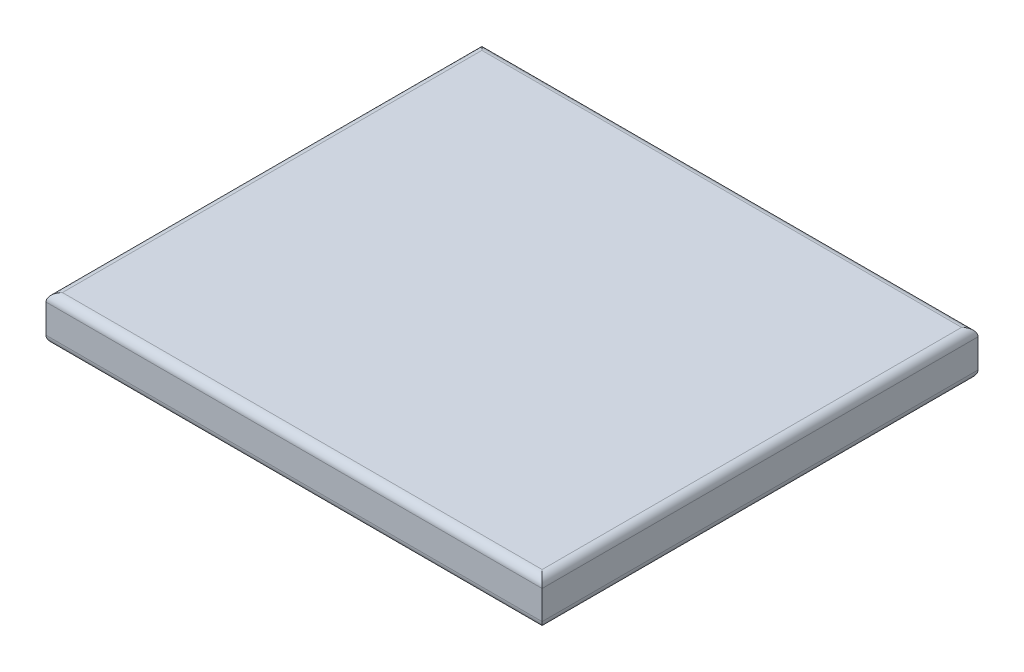
ISO-10303-21;
HEADER;
FILE_DESCRIPTION(('STEP AP214'),'2;1');
FILE_NAME('part.step','',(''),(''),'','','');
FILE_SCHEMA(('AUTOMOTIVE_DESIGN { 1 0 10303 214 1 1 1 1 }'));
ENDSEC;
DATA;
#1=APPLICATION_CONTEXT('core data for automotive mechanical design processes');
#2=APPLICATION_PROTOCOL_DEFINITION('international standard','automotive_design',2000,#1);
#3=PRODUCT_CONTEXT('',#1,'mechanical');
#4=PRODUCT('Part','Part','',(#3));
#5=PRODUCT_RELATED_PRODUCT_CATEGORY('part','',(#4));
#6=PRODUCT_DEFINITION_FORMATION('','',#4);
#7=PRODUCT_DEFINITION_CONTEXT('part definition',#1,'design');
#8=PRODUCT_DEFINITION('design','',#6,#7);
#9=PRODUCT_DEFINITION_SHAPE('','',#8);
#10=(LENGTH_UNIT() NAMED_UNIT(*) SI_UNIT(.MILLI.,.METRE.));
#11=(NAMED_UNIT(*) PLANE_ANGLE_UNIT() SI_UNIT($,.RADIAN.));
#12=(NAMED_UNIT(*) SI_UNIT($,.STERADIAN.) SOLID_ANGLE_UNIT());
#13=UNCERTAINTY_MEASURE_WITH_UNIT(LENGTH_MEASURE(1.E-05),#10,'distance_accuracy_value','');
#14=(GEOMETRIC_REPRESENTATION_CONTEXT(3) GLOBAL_UNCERTAINTY_ASSIGNED_CONTEXT((#13)) GLOBAL_UNIT_ASSIGNED_CONTEXT((#10,
#11,#12)) REPRESENTATION_CONTEXT('',''));
#15=CARTESIAN_POINT('',(0.,0.,0.));
#16=DIRECTION('',(0.,0.,1.));
#17=DIRECTION('',(1.,0.,0.));
#18=AXIS2_PLACEMENT_3D('',#15,#16,#17);
#19=CARTESIAN_POINT('',(0.,5.5,0.));
#20=DIRECTION('',(1.,0.,0.));
#21=DIRECTION('',(0.,0.,-1.));
#22=AXIS2_PLACEMENT_3D('',#19,#20,#21);
#23=PLANE('',#22);
#24=DIRECTION('',(0.,-1.,0.));
#25=VECTOR('',#24,1.);
#26=CARTESIAN_POINT('',(0.,5.5,-53.15));
#27=LINE('',#26,#25);
#28=CARTESIAN_POINT('',(0.,4.5,-53.15));
#29=VERTEX_POINT('',#28);
#30=CARTESIAN_POINT('',(0.,1.,-53.15));
#31=VERTEX_POINT('',#30);
#32=EDGE_CURVE('E142',#29,#31,#27,.T.);
#33=ORIENTED_EDGE('',*,*,#32,.T.);
#34=DIRECTION('',(0.,0.,1.));
#35=VECTOR('',#34,1.);
#36=CARTESIAN_POINT('',(0.,1.,0.));
#37=LINE('',#36,#35);
#38=CARTESIAN_POINT('',(0.,1.,0.));
#39=VERTEX_POINT('',#38);
#40=EDGE_CURVE('E151',#31,#39,#37,.T.);
#41=ORIENTED_EDGE('',*,*,#40,.T.);
#42=DIRECTION('',(0.,-1.,0.));
#43=VECTOR('',#42,1.);
#44=CARTESIAN_POINT('',(0.,5.5,0.));
#45=LINE('',#44,#43);
#46=CARTESIAN_POINT('',(0.,4.5,0.));
#47=VERTEX_POINT('',#46);
#48=EDGE_CURVE('E120',#47,#39,#45,.T.);
#49=ORIENTED_EDGE('',*,*,#48,.F.);
#50=DIRECTION('',(0.,0.,1.));
#51=VECTOR('',#50,1.);
#52=CARTESIAN_POINT('',(0.,4.5,0.));
#53=LINE('',#52,#51);
#54=EDGE_CURVE('E153',#47,#29,#53,.F.);
#55=ORIENTED_EDGE('',*,*,#54,.T.);
#56=EDGE_LOOP('',(#33,#41,#49,#55));
#57=FACE_BOUND('',#56,.T.);
#58=ADVANCED_FACE('F33',(#57),#23,.F.);
#59=CARTESIAN_POINT('',(0.,5.5,0.));
#60=DIRECTION('',(0.,0.,-1.));
#61=DIRECTION('',(-1.,0.,0.));
#62=AXIS2_PLACEMENT_3D('',#59,#60,#61);
#63=PLANE('',#62);
#64=ORIENTED_EDGE('',*,*,#48,.T.);
#65=DIRECTION('',(1.,0.,0.));
#66=VECTOR('',#65,1.);
#67=CARTESIAN_POINT('',(60.5,1.,0.));
#68=LINE('',#67,#66);
#69=CARTESIAN_POINT('',(60.5,1.,0.));
#70=VERTEX_POINT('',#69);
#71=EDGE_CURVE('E119',#39,#70,#68,.T.);
#72=ORIENTED_EDGE('',*,*,#71,.T.);
#73=DIRECTION('',(0.,-1.,0.));
#74=VECTOR('',#73,1.);
#75=CARTESIAN_POINT('',(60.5,5.5,0.));
#76=LINE('',#75,#74);
#77=CARTESIAN_POINT('',(60.5,4.5,0.));
#78=VERTEX_POINT('',#77);
#79=EDGE_CURVE('E102',#78,#70,#76,.T.);
#80=ORIENTED_EDGE('',*,*,#79,.F.);
#81=DIRECTION('',(1.,0.,0.));
#82=VECTOR('',#81,1.);
#83=CARTESIAN_POINT('',(0.,4.5,0.));
#84=LINE('',#83,#82);
#85=EDGE_CURVE('E116',#78,#47,#84,.F.);
#86=ORIENTED_EDGE('',*,*,#85,.T.);
#87=EDGE_LOOP('',(#64,#72,#80,#86));
#88=FACE_BOUND('',#87,.T.);
#89=ADVANCED_FACE('F115',(#88),#63,.F.);
#90=CARTESIAN_POINT('',(60.5,5.5,0.));
#91=DIRECTION('',(-1.,0.,0.));
#92=DIRECTION('',(0.,0.,1.));
#93=AXIS2_PLACEMENT_3D('',#90,#91,#92);
#94=PLANE('',#93);
#95=ORIENTED_EDGE('',*,*,#79,.T.);
#96=DIRECTION('',(0.,0.,-1.));
#97=VECTOR('',#96,1.);
#98=CARTESIAN_POINT('',(60.5,1.,-53.15));
#99=LINE('',#98,#97);
#100=CARTESIAN_POINT('',(60.5,1.,-53.15));
#101=VERTEX_POINT('',#100);
#102=EDGE_CURVE('E108',#70,#101,#99,.T.);
#103=ORIENTED_EDGE('',*,*,#102,.T.);
#104=DIRECTION('',(0.,-1.,0.));
#105=VECTOR('',#104,1.);
#106=CARTESIAN_POINT('',(60.5,5.5,-53.15));
#107=LINE('',#106,#105);
#108=CARTESIAN_POINT('',(60.5,4.5,-53.15));
#109=VERTEX_POINT('',#108);
#110=EDGE_CURVE('E104',#109,#101,#107,.T.);
#111=ORIENTED_EDGE('',*,*,#110,.F.);
#112=DIRECTION('',(0.,0.,-1.));
#113=VECTOR('',#112,1.);
#114=CARTESIAN_POINT('',(60.5,4.5,0.));
#115=LINE('',#114,#113);
#116=EDGE_CURVE('E99',#109,#78,#115,.F.);
#117=ORIENTED_EDGE('',*,*,#116,.T.);
#118=EDGE_LOOP('',(#95,#103,#111,#117));
#119=FACE_BOUND('',#118,.T.);
#120=ADVANCED_FACE('F101',(#119),#94,.F.);
#121=CARTESIAN_POINT('',(0.,5.5,-53.15));
#122=DIRECTION('',(0.,0.,1.));
#123=DIRECTION('',(1.,0.,0.));
#124=AXIS2_PLACEMENT_3D('',#121,#122,#123);
#125=PLANE('',#124);
#126=ORIENTED_EDGE('',*,*,#110,.T.);
#127=DIRECTION('',(-1.,0.,0.));
#128=VECTOR('',#127,1.);
#129=CARTESIAN_POINT('',(0.,1.,-53.15));
#130=LINE('',#129,#128);
#131=EDGE_CURVE('E155',#101,#31,#130,.T.);
#132=ORIENTED_EDGE('',*,*,#131,.T.);
#133=ORIENTED_EDGE('',*,*,#32,.F.);
#134=DIRECTION('',(-1.,0.,0.));
#135=VECTOR('',#134,1.);
#136=CARTESIAN_POINT('',(0.,4.5,-53.15));
#137=LINE('',#136,#135);
#138=EDGE_CURVE('E157',#29,#109,#137,.F.);
#139=ORIENTED_EDGE('',*,*,#138,.T.);
#140=EDGE_LOOP('',(#126,#132,#133,#139));
#141=FACE_BOUND('',#140,.T.);
#142=ADVANCED_FACE('F195',(#141),#125,.F.);
#143=CARTESIAN_POINT('',(0.,5.5,-53.15));
#144=DIRECTION('',(0.,-1.,0.));
#145=DIRECTION('',(0.,0.,-1.));
#146=AXIS2_PLACEMENT_3D('',#143,#144,#145);
#147=PLANE('',#146);
#148=DIRECTION('',(0.,0.,-1.));
#149=VECTOR('',#148,1.);
#150=CARTESIAN_POINT('',(59.5,5.5,-53.15));
#151=LINE('',#150,#149);
#152=CARTESIAN_POINT('',(59.5,5.5,-1.));
#153=VERTEX_POINT('',#152);
#154=CARTESIAN_POINT('',(59.5,5.5,-52.15));
#155=VERTEX_POINT('',#154);
#156=EDGE_CURVE('E42',#153,#155,#151,.T.);
#157=ORIENTED_EDGE('',*,*,#156,.T.);
#158=DIRECTION('',(-1.,0.,0.));
#159=VECTOR('',#158,1.);
#160=CARTESIAN_POINT('',(0.,5.5,-52.15));
#161=LINE('',#160,#159);
#162=CARTESIAN_POINT('',(1.,5.5,-52.15));
#163=VERTEX_POINT('',#162);
#164=EDGE_CURVE('E11',#155,#163,#161,.T.);
#165=ORIENTED_EDGE('',*,*,#164,.T.);
#166=DIRECTION('',(0.,0.,1.));
#167=VECTOR('',#166,1.);
#168=CARTESIAN_POINT('',(1.,5.5,-53.15));
#169=LINE('',#168,#167);
#170=CARTESIAN_POINT('',(1.,5.5,-1.));
#171=VERTEX_POINT('',#170);
#172=EDGE_CURVE('E149',#163,#171,#169,.T.);
#173=ORIENTED_EDGE('',*,*,#172,.T.);
#174=DIRECTION('',(1.,0.,0.));
#175=VECTOR('',#174,1.);
#176=CARTESIAN_POINT('',(0.,5.5,-1.));
#177=LINE('',#176,#175);
#178=EDGE_CURVE('E53',#171,#153,#177,.T.);
#179=ORIENTED_EDGE('',*,*,#178,.T.);
#180=EDGE_LOOP('',(#157,#165,#173,#179));
#181=FACE_BOUND('',#180,.T.);
#182=ADVANCED_FACE('F201',(#181),#147,.F.);
#183=CARTESIAN_POINT('',(0.,0.,-53.15));
#184=DIRECTION('',(0.,-1.,0.));
#185=DIRECTION('',(0.,0.,-1.));
#186=AXIS2_PLACEMENT_3D('',#183,#184,#185);
#187=PLANE('',#186);
#188=DIRECTION('',(0.,0.,-1.));
#189=VECTOR('',#188,1.);
#190=CARTESIAN_POINT('',(59.5,0.,0.));
#191=LINE('',#190,#189);
#192=CARTESIAN_POINT('',(59.5,0.,-52.15));
#193=VERTEX_POINT('',#192);
#194=CARTESIAN_POINT('',(59.5,0.,-1.));
#195=VERTEX_POINT('',#194);
#196=EDGE_CURVE('E162',#193,#195,#191,.F.);
#197=ORIENTED_EDGE('',*,*,#196,.T.);
#198=DIRECTION('',(1.,0.,0.));
#199=VECTOR('',#198,1.);
#200=CARTESIAN_POINT('',(0.,0.,-1.));
#201=LINE('',#200,#199);
#202=CARTESIAN_POINT('',(1.,0.,-1.));
#203=VERTEX_POINT('',#202);
#204=EDGE_CURVE('E109',#195,#203,#201,.F.);
#205=ORIENTED_EDGE('',*,*,#204,.T.);
#206=DIRECTION('',(0.,0.,1.));
#207=VECTOR('',#206,1.);
#208=CARTESIAN_POINT('',(1.,0.,-53.15));
#209=LINE('',#208,#207);
#210=CARTESIAN_POINT('',(1.,0.,-52.15));
#211=VERTEX_POINT('',#210);
#212=EDGE_CURVE('E166',#203,#211,#209,.F.);
#213=ORIENTED_EDGE('',*,*,#212,.T.);
#214=DIRECTION('',(-1.,0.,0.));
#215=VECTOR('',#214,1.);
#216=CARTESIAN_POINT('',(60.5,0.,-52.15));
#217=LINE('',#216,#215);
#218=EDGE_CURVE('E164',#211,#193,#217,.F.);
#219=ORIENTED_EDGE('',*,*,#218,.T.);
#220=EDGE_LOOP('',(#197,#205,#213,#219));
#221=FACE_BOUND('',#220,.T.);
#222=ADVANCED_FACE('F203',(#221),#187,.T.);
#223=CARTESIAN_POINT('',(0.,1.,-52.15));
#224=DIRECTION('',(1.,0.,0.));
#225=DIRECTION('',(0.,0.,-1.));
#226=AXIS2_PLACEMENT_3D('',#223,#224,#225);
#227=CYLINDRICAL_SURFACE('',#226,1.);
#228=CARTESIAN_POINT('',(59.5,1.,-52.15));
#229=DIRECTION('',(0.707106781186547,0.,0.707106781186547));
#230=DIRECTION('',(0.707106781186547,0.,-0.707106781186547));
#231=AXIS2_PLACEMENT_3D('',#228,#229,#230);
#232=ELLIPSE('',#231,1.41421356237309,1.);
#233=EDGE_CURVE('E143',#193,#101,#232,.T.);
#234=ORIENTED_EDGE('',*,*,#233,.F.);
#235=ORIENTED_EDGE('',*,*,#218,.F.);
#236=CARTESIAN_POINT('',(1.,1.,-52.15));
#237=DIRECTION('',(0.707106781186547,0.,-0.707106781186547));
#238=DIRECTION('',(-0.707106781186547,0.,-0.707106781186547));
#239=AXIS2_PLACEMENT_3D('',#236,#237,#238);
#240=ELLIPSE('',#239,1.41421356237309,1.);
#241=EDGE_CURVE('E139',#31,#211,#240,.F.);
#242=ORIENTED_EDGE('',*,*,#241,.F.);
#243=ORIENTED_EDGE('',*,*,#131,.F.);
#244=EDGE_LOOP('',(#234,#235,#242,#243));
#245=FACE_BOUND('',#244,.T.);
#246=ADVANCED_FACE('F182',(#245),#227,.T.);
#247=CARTESIAN_POINT('',(1.,1.,0.));
#248=DIRECTION('',(0.,0.,-1.));
#249=DIRECTION('',(-1.,0.,0.));
#250=AXIS2_PLACEMENT_3D('',#247,#248,#249);
#251=CYLINDRICAL_SURFACE('',#250,1.);
#252=ORIENTED_EDGE('',*,*,#241,.T.);
#253=ORIENTED_EDGE('',*,*,#212,.F.);
#254=CARTESIAN_POINT('',(1.,1.,-1.));
#255=DIRECTION('',(-0.707106781186547,0.,-0.707106781186547));
#256=DIRECTION('',(0.707106781186547,0.,-0.707106781186547));
#257=AXIS2_PLACEMENT_3D('',#254,#255,#256);
#258=ELLIPSE('',#257,1.41421356237309,1.);
#259=EDGE_CURVE('E130',#39,#203,#258,.F.);
#260=ORIENTED_EDGE('',*,*,#259,.F.);
#261=ORIENTED_EDGE('',*,*,#40,.F.);
#262=EDGE_LOOP('',(#252,#253,#260,#261));
#263=FACE_BOUND('',#262,.T.);
#264=ADVANCED_FACE('F186',(#263),#251,.T.);
#265=CARTESIAN_POINT('',(59.5,1.,0.));
#266=DIRECTION('',(0.,0.,1.));
#267=DIRECTION('',(1.,0.,0.));
#268=AXIS2_PLACEMENT_3D('',#265,#266,#267);
#269=CYLINDRICAL_SURFACE('',#268,1.);
#270=ORIENTED_EDGE('',*,*,#233,.T.);
#271=ORIENTED_EDGE('',*,*,#102,.F.);
#272=CARTESIAN_POINT('',(59.5,1.,-1.));
#273=DIRECTION('',(-0.707106781186547,0.,0.707106781186547));
#274=DIRECTION('',(0.707106781186547,0.,0.707106781186547));
#275=AXIS2_PLACEMENT_3D('',#272,#273,#274);
#276=ELLIPSE('',#275,1.41421356237309,1.);
#277=EDGE_CURVE('E129',#195,#70,#276,.T.);
#278=ORIENTED_EDGE('',*,*,#277,.F.);
#279=ORIENTED_EDGE('',*,*,#196,.F.);
#280=EDGE_LOOP('',(#270,#271,#278,#279));
#281=FACE_BOUND('',#280,.T.);
#282=ADVANCED_FACE('F194',(#281),#269,.T.);
#283=CARTESIAN_POINT('',(0.,1.,-1.));
#284=DIRECTION('',(-1.,0.,0.));
#285=DIRECTION('',(0.,0.,1.));
#286=AXIS2_PLACEMENT_3D('',#283,#284,#285);
#287=CYLINDRICAL_SURFACE('',#286,1.);
#288=ORIENTED_EDGE('',*,*,#259,.T.);
#289=ORIENTED_EDGE('',*,*,#204,.F.);
#290=ORIENTED_EDGE('',*,*,#277,.T.);
#291=ORIENTED_EDGE('',*,*,#71,.F.);
#292=EDGE_LOOP('',(#288,#289,#290,#291));
#293=FACE_BOUND('',#292,.T.);
#294=ADVANCED_FACE('F189',(#293),#287,.T.);
#295=CARTESIAN_POINT('',(0.,4.5,-1.));
#296=DIRECTION('',(1.,0.,0.));
#297=DIRECTION('',(0.,0.,-1.));
#298=AXIS2_PLACEMENT_3D('',#295,#296,#297);
#299=CYLINDRICAL_SURFACE('',#298,1.);
#300=CARTESIAN_POINT('',(1.,4.5,-1.));
#301=DIRECTION('',(0.707106781186547,0.,0.707106781186547));
#302=DIRECTION('',(-0.707106781186547,0.,0.707106781186547));
#303=AXIS2_PLACEMENT_3D('',#300,#301,#302);
#304=ELLIPSE('',#303,1.41421356237309,1.);
#305=EDGE_CURVE('E125',#47,#171,#304,.F.);
#306=ORIENTED_EDGE('',*,*,#305,.F.);
#307=ORIENTED_EDGE('',*,*,#85,.F.);
#308=CARTESIAN_POINT('',(59.5,4.5,-1.));
#309=DIRECTION('',(0.707106781186547,0.,-0.707106781186547));
#310=DIRECTION('',(0.707106781186547,0.,0.707106781186547));
#311=AXIS2_PLACEMENT_3D('',#308,#309,#310);
#312=ELLIPSE('',#311,1.41421356237309,1.);
#313=EDGE_CURVE('E37',#153,#78,#312,.T.);
#314=ORIENTED_EDGE('',*,*,#313,.F.);
#315=ORIENTED_EDGE('',*,*,#178,.F.);
#316=EDGE_LOOP('',(#306,#307,#314,#315));
#317=FACE_BOUND('',#316,.T.);
#318=ADVANCED_FACE('F35',(#317),#299,.T.);
#319=CARTESIAN_POINT('',(59.5,4.5,-53.15));
#320=DIRECTION('',(0.,0.,-1.));
#321=DIRECTION('',(-1.,0.,0.));
#322=AXIS2_PLACEMENT_3D('',#319,#320,#321);
#323=CYLINDRICAL_SURFACE('',#322,1.);
#324=ORIENTED_EDGE('',*,*,#313,.T.);
#325=ORIENTED_EDGE('',*,*,#116,.F.);
#326=CARTESIAN_POINT('',(59.5,4.5,-52.15));
#327=DIRECTION('',(-0.707106781186547,0.,-0.707106781186547));
#328=DIRECTION('',(0.707106781186547,0.,-0.707106781186547));
#329=AXIS2_PLACEMENT_3D('',#326,#327,#328);
#330=ELLIPSE('',#329,1.41421356237309,1.);
#331=EDGE_CURVE('E132',#155,#109,#330,.T.);
#332=ORIENTED_EDGE('',*,*,#331,.F.);
#333=ORIENTED_EDGE('',*,*,#156,.F.);
#334=EDGE_LOOP('',(#324,#325,#332,#333));
#335=FACE_BOUND('',#334,.T.);
#336=ADVANCED_FACE('F128',(#335),#323,.T.);
#337=CARTESIAN_POINT('',(1.,4.5,-53.15));
#338=DIRECTION('',(0.,0.,1.));
#339=DIRECTION('',(1.,0.,0.));
#340=AXIS2_PLACEMENT_3D('',#337,#338,#339);
#341=CYLINDRICAL_SURFACE('',#340,1.);
#342=ORIENTED_EDGE('',*,*,#305,.T.);
#343=ORIENTED_EDGE('',*,*,#172,.F.);
#344=CARTESIAN_POINT('',(1.,4.5,-52.15));
#345=DIRECTION('',(-0.707106781186547,0.,0.707106781186547));
#346=DIRECTION('',(0.707106781186547,0.,0.707106781186547));
#347=AXIS2_PLACEMENT_3D('',#344,#345,#346);
#348=ELLIPSE('',#347,1.41421356237309,1.);
#349=EDGE_CURVE('E135',#29,#163,#348,.F.);
#350=ORIENTED_EDGE('',*,*,#349,.F.);
#351=ORIENTED_EDGE('',*,*,#54,.F.);
#352=EDGE_LOOP('',(#342,#343,#350,#351));
#353=FACE_BOUND('',#352,.T.);
#354=ADVANCED_FACE('F200',(#353),#341,.T.);
#355=CARTESIAN_POINT('',(0.,4.5,-52.15));
#356=DIRECTION('',(-1.,0.,0.));
#357=DIRECTION('',(0.,0.,1.));
#358=AXIS2_PLACEMENT_3D('',#355,#356,#357);
#359=CYLINDRICAL_SURFACE('',#358,1.);
#360=ORIENTED_EDGE('',*,*,#331,.T.);
#361=ORIENTED_EDGE('',*,*,#138,.F.);
#362=ORIENTED_EDGE('',*,*,#349,.T.);
#363=ORIENTED_EDGE('',*,*,#164,.F.);
#364=EDGE_LOOP('',(#360,#361,#362,#363));
#365=FACE_BOUND('',#364,.T.);
#366=ADVANCED_FACE('F198',(#365),#359,.T.);
#367=CLOSED_SHELL('',(#58,#89,#120,#142,#182,#222,#246,#264,#282,#294,#318,#336,#354,#366));
#368=MANIFOLD_SOLID_BREP('B2',#367);
#369=ADVANCED_BREP_SHAPE_REPRESENTATION('',(#18,#368),#14);
#370=SHAPE_DEFINITION_REPRESENTATION(#9,#369);
ENDSEC;
END-ISO-10303-21;
